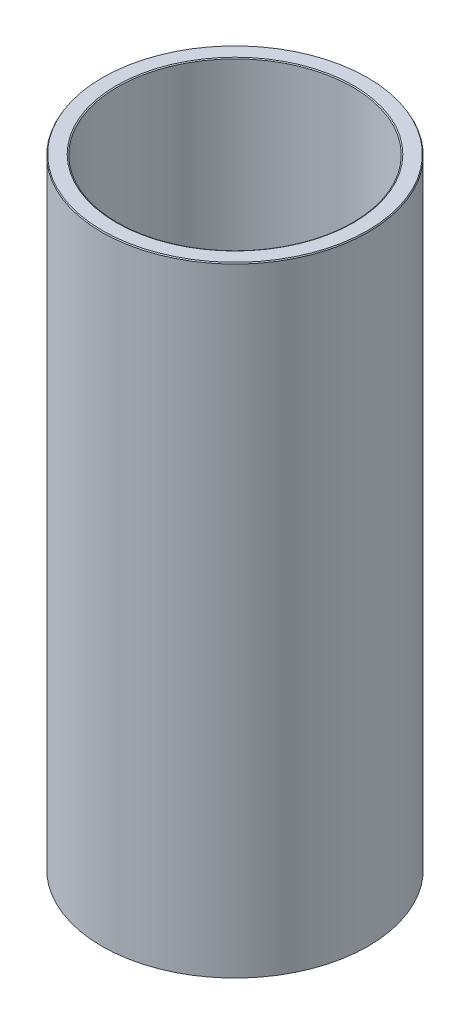
ISO-10303-21;
HEADER;
FILE_DESCRIPTION(('STEP AP214'),'2;1');
FILE_NAME('part.step','',(''),(''),'','','');
FILE_SCHEMA(('AUTOMOTIVE_DESIGN { 1 0 10303 214 1 1 1 1 }'));
ENDSEC;
DATA;
#1=APPLICATION_CONTEXT('core data for automotive mechanical design processes');
#2=APPLICATION_PROTOCOL_DEFINITION('international standard','automotive_design',2000,#1);
#3=PRODUCT_CONTEXT('',#1,'mechanical');
#4=PRODUCT('Part','Part','',(#3));
#5=PRODUCT_RELATED_PRODUCT_CATEGORY('part','',(#4));
#6=PRODUCT_DEFINITION_FORMATION('','',#4);
#7=PRODUCT_DEFINITION_CONTEXT('part definition',#1,'design');
#8=PRODUCT_DEFINITION('design','',#6,#7);
#9=PRODUCT_DEFINITION_SHAPE('','',#8);
#10=(LENGTH_UNIT() NAMED_UNIT(*) SI_UNIT(.MILLI.,.METRE.));
#11=(NAMED_UNIT(*) PLANE_ANGLE_UNIT() SI_UNIT($,.RADIAN.));
#12=(NAMED_UNIT(*) SI_UNIT($,.STERADIAN.) SOLID_ANGLE_UNIT());
#13=UNCERTAINTY_MEASURE_WITH_UNIT(LENGTH_MEASURE(1.E-05),#10,'distance_accuracy_value','');
#14=(GEOMETRIC_REPRESENTATION_CONTEXT(3) GLOBAL_UNCERTAINTY_ASSIGNED_CONTEXT((#13)) GLOBAL_UNIT_ASSIGNED_CONTEXT((#10,
#11,#12)) REPRESENTATION_CONTEXT('',''));
#15=CARTESIAN_POINT('',(0.,0.,0.));
#16=DIRECTION('',(0.,0.,1.));
#17=DIRECTION('',(1.,0.,0.));
#18=AXIS2_PLACEMENT_3D('',#15,#16,#17);
#19=CARTESIAN_POINT('',(0.,186.253668168116,0.));
#20=DIRECTION('',(0.,-1.,0.));
#21=DIRECTION('',(0.,0.,-1.));
#22=AXIS2_PLACEMENT_3D('',#19,#20,#21);
#23=CYLINDRICAL_SURFACE('',#22,40.);
#24=CARTESIAN_POINT('',(0.,0.194011640771735,0.));
#25=DIRECTION('',(0.,1.,0.));
#26=DIRECTION('',(0.,0.,1.));
#27=AXIS2_PLACEMENT_3D('',#24,#25,#26);
#28=CIRCLE('',#27,40.);
#29=CARTESIAN_POINT('',(0.,0.194011640771735,40.));
#30=VERTEX_POINT('',#29);
#31=EDGE_CURVE('E10',#30,#30,#28,.T.);
#32=ORIENTED_EDGE('',*,*,#31,.T.);
#33=EDGE_LOOP('',(#32));
#34=FACE_BOUND('',#33,.T.);
#35=CARTESIAN_POINT('',(0.,185.917630149039,0.));
#36=DIRECTION('',(0.,1.,0.));
#37=DIRECTION('',(0.,0.,1.));
#38=AXIS2_PLACEMENT_3D('',#35,#36,#37);
#39=CIRCLE('',#38,40.);
#40=CARTESIAN_POINT('',(0.,185.917630149039,40.));
#41=VERTEX_POINT('',#40);
#42=EDGE_CURVE('E50',#41,#41,#39,.F.);
#43=ORIENTED_EDGE('',*,*,#42,.T.);
#44=EDGE_LOOP('',(#43));
#45=FACE_BOUND('',#44,.T.);
#46=ADVANCED_FACE('F39',(#34,#45),#23,.T.);
#47=CARTESIAN_POINT('',(0.,186.253668168116,0.));
#48=DIRECTION('',(0.,1.,0.));
#49=DIRECTION('',(0.,0.,1.));
#50=AXIS2_PLACEMENT_3D('',#47,#48,#49);
#51=PLANE('',#50);
#52=CARTESIAN_POINT('',(0.,186.253668168116,0.));
#53=DIRECTION('',(0.,1.,0.));
#54=DIRECTION('',(0.,0.,1.));
#55=AXIS2_PLACEMENT_3D('',#52,#53,#54);
#56=CIRCLE('',#55,35.6508248401916);
#57=CARTESIAN_POINT('',(0.,186.253668168116,35.6508248401916));
#58=VERTEX_POINT('',#57);
#59=EDGE_CURVE('E58',#58,#58,#56,.F.);
#60=ORIENTED_EDGE('',*,*,#59,.T.);
#61=EDGE_LOOP('',(#60));
#62=FACE_BOUND('',#61,.T.);
#63=CARTESIAN_POINT('',(0.,186.253668168116,0.));
#64=DIRECTION('',(0.,1.,0.));
#65=DIRECTION('',(0.,0.,1.));
#66=AXIS2_PLACEMENT_3D('',#63,#64,#65);
#67=CIRCLE('',#66,39.8059883592282);
#68=CARTESIAN_POINT('',(0.,186.253668168116,39.8059883592282));
#69=VERTEX_POINT('',#68);
#70=EDGE_CURVE('E61',#69,#69,#67,.T.);
#71=ORIENTED_EDGE('',*,*,#70,.T.);
#72=EDGE_LOOP('',(#71));
#73=FACE_BOUND('',#72,.T.);
#74=ADVANCED_FACE('F88',(#62,#73),#51,.T.);
#75=CARTESIAN_POINT('',(0.,0.,0.));
#76=DIRECTION('',(0.,1.,0.));
#77=DIRECTION('',(0.,0.,1.));
#78=AXIS2_PLACEMENT_3D('',#75,#76,#77);
#79=PLANE('',#78);
#80=CARTESIAN_POINT('',(0.,0.,0.));
#81=DIRECTION('',(0.,1.,0.));
#82=DIRECTION('',(0.,0.,1.));
#83=AXIS2_PLACEMENT_3D('',#80,#81,#82);
#84=CIRCLE('',#83,35.5087984618869);
#85=CARTESIAN_POINT('',(0.,0.,35.5087984618869));
#86=VERTEX_POINT('',#85);
#87=EDGE_CURVE('E51',#86,#86,#84,.T.);
#88=ORIENTED_EDGE('',*,*,#87,.T.);
#89=EDGE_LOOP('',(#88));
#90=FACE_BOUND('',#89,.T.);
#91=CARTESIAN_POINT('',(0.,0.,0.));
#92=DIRECTION('',(0.,1.,0.));
#93=DIRECTION('',(0.,0.,1.));
#94=AXIS2_PLACEMENT_3D('',#91,#92,#93);
#95=CIRCLE('',#94,39.6639619809236);
#96=CARTESIAN_POINT('',(0.,0.,39.6639619809236));
#97=VERTEX_POINT('',#96);
#98=EDGE_CURVE('E54',#97,#97,#95,.F.);
#99=ORIENTED_EDGE('',*,*,#98,.T.);
#100=EDGE_LOOP('',(#99));
#101=FACE_BOUND('',#100,.T.);
#102=ADVANCED_FACE('F83',(#90,#101),#79,.F.);
#103=CARTESIAN_POINT('',(0.,186.253668168116,0.));
#104=DIRECTION('',(0.,-1.,0.));
#105=DIRECTION('',(0.,0.,-1.));
#106=AXIS2_PLACEMENT_3D('',#103,#104,#105);
#107=CYLINDRICAL_SURFACE('',#106,35.3147868211152);
#108=CARTESIAN_POINT('',(0.,186.059656527344,0.));
#109=DIRECTION('',(0.,1.,0.));
#110=DIRECTION('',(0.,0.,1.));
#111=AXIS2_PLACEMENT_3D('',#108,#109,#110);
#112=CIRCLE('',#111,35.3147868211152);
#113=CARTESIAN_POINT('',(0.,186.059656527344,35.3147868211152));
#114=VERTEX_POINT('',#113);
#115=EDGE_CURVE('E67',#114,#114,#112,.T.);
#116=ORIENTED_EDGE('',*,*,#115,.T.);
#117=EDGE_LOOP('',(#116));
#118=FACE_BOUND('',#117,.T.);
#119=CARTESIAN_POINT('',(0.,0.336038019076473,0.));
#120=DIRECTION('',(0.,1.,0.));
#121=DIRECTION('',(0.,0.,1.));
#122=AXIS2_PLACEMENT_3D('',#119,#120,#121);
#123=CIRCLE('',#122,35.3147868211152);
#124=CARTESIAN_POINT('',(0.,0.336038019076473,35.3147868211152));
#125=VERTEX_POINT('',#124);
#126=EDGE_CURVE('E69',#125,#125,#123,.F.);
#127=ORIENTED_EDGE('',*,*,#126,.T.);
#128=EDGE_LOOP('',(#127));
#129=FACE_BOUND('',#128,.T.);
#130=ADVANCED_FACE('F71',(#118,#129),#107,.F.);
#131=CARTESIAN_POINT('',(0.,186.059656527344,0.));
#132=DIRECTION('',(0.,1.,0.));
#133=DIRECTION('',(0.,0.,1.));
#134=AXIS2_PLACEMENT_3D('',#131,#132,#133);
#135=CONICAL_SURFACE('',#134,35.3147868211152,1.04719755119661);
#136=CARTESIAN_POINT('',(0.,186.253668168116,35.6508248401916));
#137=CARTESIAN_POINT('',(0.,186.251647213525,35.6473244441596));
#138=CARTESIAN_POINT('',(0.,186.249626258933,35.6438240481275));
#139=CARTESIAN_POINT('',(0.,186.24558434975,35.6368232560634));
#140=CARTESIAN_POINT('',(0.,186.243563395159,35.6333228600314));
#141=CARTESIAN_POINT('',(0.,186.239521485976,35.6263220679673));
#142=CARTESIAN_POINT('',(0.,186.237500531385,35.6228216719352));
#143=CARTESIAN_POINT('',(0.,186.233458622202,35.6158208798711));
#144=CARTESIAN_POINT('',(0.,186.231437667611,35.6123204838391));
#145=CARTESIAN_POINT('',(0.,186.227395758428,35.605319691775));
#146=CARTESIAN_POINT('',(0.,186.225374803837,35.601819295743));
#147=CARTESIAN_POINT('',(0.,186.221332894654,35.5948185036789));
#148=CARTESIAN_POINT('',(0.,186.219311940063,35.5913181076468));
#149=CARTESIAN_POINT('',(0.,186.21527003088,35.5843173155827));
#150=CARTESIAN_POINT('',(0.,186.213249076288,35.5808169195507));
#151=CARTESIAN_POINT('',(0.,186.209207167106,35.5738161274866));
#152=CARTESIAN_POINT('',(0.,186.207186212514,35.5703157314545));
#153=CARTESIAN_POINT('',(0.,186.203144303332,35.5633149393905));
#154=CARTESIAN_POINT('',(0.,186.20112334874,35.5598145433584));
#155=CARTESIAN_POINT('',(0.,186.197081439557,35.5528137512943));
#156=CARTESIAN_POINT('',(0.,186.195060484966,35.5493133552623));
#157=CARTESIAN_POINT('',(0.,186.191018575783,35.5423125631982));
#158=CARTESIAN_POINT('',(0.,186.188997621192,35.5388121671661));
#159=CARTESIAN_POINT('',(0.,186.184955712009,35.531811375102));
#160=CARTESIAN_POINT('',(0.,186.182934757418,35.52831097907));
#161=CARTESIAN_POINT('',(0.,186.178892848235,35.5213101870059));
#162=CARTESIAN_POINT('',(0.,186.176871893644,35.5178097909738));
#163=CARTESIAN_POINT('',(0.,186.172829984461,35.5108089989098));
#164=CARTESIAN_POINT('',(0.,186.17080902987,35.5073086028777));
#165=CARTESIAN_POINT('',(0.,186.166767120687,35.5003078108136));
#166=CARTESIAN_POINT('',(0.,186.164746166096,35.4968074147816));
#167=CARTESIAN_POINT('',(0.,186.160704256913,35.4898066227175));
#168=CARTESIAN_POINT('',(0.,186.158683302321,35.4863062266854));
#169=CARTESIAN_POINT('',(0.,186.154641393139,35.4793054346213));
#170=CARTESIAN_POINT('',(0.,186.152620438547,35.4758050385893));
#171=CARTESIAN_POINT('',(0.,186.148578529365,35.4688042465252));
#172=CARTESIAN_POINT('',(0.,186.146557574773,35.4653038504932));
#173=CARTESIAN_POINT('',(0.,186.14251566559,35.4583030584291));
#174=CARTESIAN_POINT('',(0.,186.140494710999,35.454802662397));
#175=CARTESIAN_POINT('',(0.,186.136452801816,35.4478018703329));
#176=CARTESIAN_POINT('',(0.,186.134431847225,35.4443014743009));
#177=CARTESIAN_POINT('',(0.,186.130389938042,35.4373006822368));
#178=CARTESIAN_POINT('',(0.,186.128368983451,35.4338002862047));
#179=CARTESIAN_POINT('',(0.,186.124327074268,35.4267994941406));
#180=CARTESIAN_POINT('',(0.,186.122306119677,35.4232990981086));
#181=CARTESIAN_POINT('',(0.,186.118264210494,35.4162983060445));
#182=CARTESIAN_POINT('',(0.,186.116243255903,35.4127979100125));
#183=CARTESIAN_POINT('',(0.,186.11220134672,35.4057971179484));
#184=CARTESIAN_POINT('',(0.,186.110180392128,35.4022967219163));
#185=CARTESIAN_POINT('',(0.,186.106138482946,35.3952959298522));
#186=CARTESIAN_POINT('',(0.,186.104117528354,35.3917955338202));
#187=CARTESIAN_POINT('',(0.,186.100075619172,35.3847947417561));
#188=CARTESIAN_POINT('',(0.,186.09805466458,35.381294345724));
#189=CARTESIAN_POINT('',(0.,186.094012755398,35.3742935536599));
#190=CARTESIAN_POINT('',(0.,186.091991800806,35.3707931576279));
#191=CARTESIAN_POINT('',(0.,186.087949891623,35.3637923655638));
#192=CARTESIAN_POINT('',(0.,186.085928937032,35.3602919695318));
#193=CARTESIAN_POINT('',(0.,186.081887027849,35.3532911774677));
#194=CARTESIAN_POINT('',(0.,186.079866073258,35.3497907814356));
#195=CARTESIAN_POINT('',(0.,186.075824164075,35.3427899893715));
#196=CARTESIAN_POINT('',(0.,186.073803209484,35.3392895933395));
#197=CARTESIAN_POINT('',(0.,186.069761300301,35.3322888012754));
#198=CARTESIAN_POINT('',(0.,186.06774034571,35.3287884052433));
#199=CARTESIAN_POINT('',(0.,186.063698436527,35.3217876131793));
#200=CARTESIAN_POINT('',(0.,186.061677481936,35.3182872171472));
#201=CARTESIAN_POINT('',(0.,186.059656527344,35.3147868211152));
#202=B_SPLINE_CURVE_WITH_KNOTS('',3,(#136,#137,#138,#139,#140,#141,#142,#143,#144,#145,#146,
#147,#148,#149,#150,#151,#152,#153,#154,#155,#156,#157,#158,#159,#160,#161,#162,#163,#164,#165,
#166,#167,#168,#169,#170,#171,#172,#173,#174,#175,#176,#177,#178,#179,#180,#181,#182,#183,#184,
#185,#186,#187,#188,#189,#190,#191,#192,#193,#194,#195,#196,#197,#198,#199,#200,#201),
.UNSPECIFIED.,.F.,.F.,(4,2,2,2,2,2,2,2,2,2,2,2,2,2,2,2,2,2,2,2,2,2,2,2,2,2,2,2,2,2,2,2,4),(0.,
0.0121257275482494,0.0242514550964789,0.0363771826447084,0.0485029101929518,0.0606286377411813,
0.0727543652894108,0.0848800928376403,0.0970058203858837,0.109131547934113,0.121257275482343,
0.133383003030586,0.145508730578816,0.157634458127045,0.169760185675275,0.181885913223518,
0.194011640771748,0.206137368319983,0.218263095868227,0.230388823416456,0.242514550964686,
0.254640278512915,0.266766006061158,0.278891733609388,0.291017461157617,0.303143188705861,
0.31526891625409,0.32739464380232,0.339520371350549,0.351646098898793,0.363771826447022,
0.375897553995252,0.388023281543481),.UNSPECIFIED.);
#203=EDGE_CURVE('BSEAM77',#58,#114,#202,.T.);
#204=ORIENTED_EDGE('',*,*,#59,.F.);
#205=ORIENTED_EDGE('',*,*,#115,.F.);
#206=ORIENTED_EDGE('',*,*,#203,.T.);
#207=ORIENTED_EDGE('',*,*,#203,.F.);
#208=EDGE_LOOP('',(#204,#206,#205,#207));
#209=FACE_BOUND('',#208,.T.);
#210=ADVANCED_FACE('F77',(#209),#135,.F.);
#211=CARTESIAN_POINT('',(0.,0.,0.));
#212=DIRECTION('',(0.,-1.,0.));
#213=DIRECTION('',(0.,0.,-1.));
#214=AXIS2_PLACEMENT_3D('',#211,#212,#213);
#215=CONICAL_SURFACE('',#214,35.5087984618869,0.523598775598327);
#216=ORIENTED_EDGE('',*,*,#126,.F.);
#217=EDGE_LOOP('',(#216));
#218=FACE_BOUND('',#217,.T.);
#219=ORIENTED_EDGE('',*,*,#87,.F.);
#220=EDGE_LOOP('',(#219));
#221=FACE_BOUND('',#220,.T.);
#222=ADVANCED_FACE('F73',(#218,#221),#215,.F.);
#223=CARTESIAN_POINT('',(0.,0.194011640771735,0.));
#224=DIRECTION('',(0.,1.,0.));
#225=DIRECTION('',(0.,0.,1.));
#226=AXIS2_PLACEMENT_3D('',#223,#224,#225);
#227=CONICAL_SURFACE('',#226,40.,1.04719755119655);
#228=CARTESIAN_POINT('',(0.,0.,39.6639619809236));
#229=CARTESIAN_POINT('',(0.,0.00202095459137203,39.6674623769556));
#230=CARTESIAN_POINT('',(0.,0.00404190918274436,39.6709627729877));
#231=CARTESIAN_POINT('',(0.,0.00808381836548903,39.6779635650518));
#232=CARTESIAN_POINT('',(0.,0.0101047729568614,39.6814639610838));
#233=CARTESIAN_POINT('',(0.,0.0141466821396055,39.6884647531479));
#234=CARTESIAN_POINT('',(0.,0.0161676367309773,39.69196514918));
#235=CARTESIAN_POINT('',(0.,0.020209545913722,39.698965941244));
#236=CARTESIAN_POINT('',(0.,0.022230500505095,39.7024663372761));
#237=CARTESIAN_POINT('',(0.,0.0262724096878397,39.7094671293402));
#238=CARTESIAN_POINT('',(0.,0.0282933642792115,39.7129675253722));
#239=CARTESIAN_POINT('',(0.,0.0323352734619557,39.7199683174363));
#240=CARTESIAN_POINT('',(0.,0.034356228053328,39.7234687134684));
#241=CARTESIAN_POINT('',(0.,0.0383981372360726,39.7304695055325));
#242=CARTESIAN_POINT('',(0.,0.0404190918274448,39.7339699015645));
#243=CARTESIAN_POINT('',(0.,0.0444610010101893,39.7409706936286));
#244=CARTESIAN_POINT('',(0.,0.0464819556015617,39.7444710896606));
#245=CARTESIAN_POINT('',(0.,0.0505238647843058,39.7514718817247));
#246=CARTESIAN_POINT('',(0.,0.0525448193756776,39.7549722777568));
#247=CARTESIAN_POINT('',(0.,0.0565867285584224,39.7619730698209));
#248=CARTESIAN_POINT('',(0.,0.0586076831497953,39.7654734658529));
#249=CARTESIAN_POINT('',(0.,0.0626495923325401,39.772474257917));
#250=CARTESIAN_POINT('',(0.,0.0646705469239119,39.7759746539491));
#251=CARTESIAN_POINT('',(0.,0.068712456106656,39.7829754460131));
#252=CARTESIAN_POINT('',(0.,0.0707334106980284,39.7864758420452));
#253=CARTESIAN_POINT('',(0.,0.0747753198807729,39.7934766341093));
#254=CARTESIAN_POINT('',(0.,0.0767962744721451,39.7969770301413));
#255=CARTESIAN_POINT('',(0.,0.0808381836548897,39.8039778222054));
#256=CARTESIAN_POINT('',(0.,0.082859138246262,39.8074782182375));
#257=CARTESIAN_POINT('',(0.,0.0869010474290062,39.8144790103016));
#258=CARTESIAN_POINT('',(0.,0.088922002020378,39.8179794063336));
#259=CARTESIAN_POINT('',(0.,0.0929639112031227,39.8249801983977));
#260=CARTESIAN_POINT('',(0.,0.0949848657944957,39.8284805944297));
#261=CARTESIAN_POINT('',(0.,0.0990267749772404,39.8354813864938));
#262=CARTESIAN_POINT('',(0.,0.101047729568612,39.8389817825259));
#263=CARTESIAN_POINT('',(0.,0.105089638751356,39.84598257459));
#264=CARTESIAN_POINT('',(0.,0.107110593342729,39.849482970622));
#265=CARTESIAN_POINT('',(0.,0.111152502525473,39.8564837626861));
#266=CARTESIAN_POINT('',(0.,0.113173457116846,39.8599841587182));
#267=CARTESIAN_POINT('',(0.,0.11721536629959,39.8669849507823));
#268=CARTESIAN_POINT('',(0.,0.119236320890962,39.8704853468143));
#269=CARTESIAN_POINT('',(0.,0.123278230073707,39.8774861388784));
#270=CARTESIAN_POINT('',(0.,0.125299184665079,39.8809865349104));
#271=CARTESIAN_POINT('',(0.,0.129341093847823,39.8879873269745));
#272=CARTESIAN_POINT('',(0.,0.131362048439195,39.8914877230066));
#273=CARTESIAN_POINT('',(0.,0.13540395762194,39.8984885150707));
#274=CARTESIAN_POINT('',(0.,0.137424912213313,39.9019889111027));
#275=CARTESIAN_POINT('',(0.,0.141466821396058,39.9089897031668));
#276=CARTESIAN_POINT('',(0.,0.143487775987429,39.9124900991989));
#277=CARTESIAN_POINT('',(0.,0.147529685170173,39.9194908912629));
#278=CARTESIAN_POINT('',(0.,0.149550639761546,39.922991287295));
#279=CARTESIAN_POINT('',(0.,0.15359254894429,39.9299920793591));
#280=CARTESIAN_POINT('',(0.,0.155613503535663,39.9334924753911));
#281=CARTESIAN_POINT('',(0.,0.159655412718407,39.9404932674552));
#282=CARTESIAN_POINT('',(0.,0.161676367309779,39.9439936634873));
#283=CARTESIAN_POINT('',(0.,0.165718276492524,39.9509944555514));
#284=CARTESIAN_POINT('',(0.,0.167739231083895,39.9544948515834));
#285=CARTESIAN_POINT('',(0.,0.17178114026664,39.9614956436475));
#286=CARTESIAN_POINT('',(0.,0.173802094858013,39.9649960396795));
#287=CARTESIAN_POINT('',(0.,0.177844004040758,39.9719968317436));
#288=CARTESIAN_POINT('',(0.,0.17986495863213,39.9754972277757));
#289=CARTESIAN_POINT('',(0.,0.183906867814874,39.9824980198398));
#290=CARTESIAN_POINT('',(0.,0.185927822406246,39.9859984158718));
#291=CARTESIAN_POINT('',(0.,0.189969731588991,39.9929992079359));
#292=CARTESIAN_POINT('',(0.,0.191990686180363,39.996499603968));
#293=CARTESIAN_POINT('',(0.,0.194011640771735,40.));
#294=B_SPLINE_CURVE_WITH_KNOTS('',3,(#228,#229,#230,#231,#232,#233,#234,#235,#236,#237,#238,
#239,#240,#241,#242,#243,#244,#245,#246,#247,#248,#249,#250,#251,#252,#253,#254,#255,#256,#257,
#258,#259,#260,#261,#262,#263,#264,#265,#266,#267,#268,#269,#270,#271,#272,#273,#274,#275,#276,
#277,#278,#279,#280,#281,#282,#283,#284,#285,#286,#287,#288,#289,#290,#291,#292,#293),
.UNSPECIFIED.,.F.,.F.,(4,2,2,2,2,2,2,2,2,2,2,2,2,2,2,2,2,2,2,2,2,2,2,2,2,2,2,2,2,2,2,2,4),(0.,
0.0121257275482334,0.0242514550964668,0.0363771826447002,0.0485029101929276,0.0606286377411611,
0.0727543652893945,0.0848800928376279,0.0970058203858613,0.109131547934095,0.121257275482322,
0.133383003030556,0.145508730578789,0.157634458127022,0.169760185675256,0.181885913223489,
0.194011640771717,0.20613736831995,0.218263095868183,0.230388823416417,0.24251455096465,
0.254640278512884,0.266766006061117,0.278891733609345,0.291017461157578,0.303143188705811,
0.315268916254045,0.327394643802278,0.339520371350512,0.351646098898739,0.363771826446972,
0.375897553995206,0.388023281543439),.UNSPECIFIED.);
#295=EDGE_CURVE('BSEAM76',#97,#30,#294,.T.);
#296=ORIENTED_EDGE('',*,*,#98,.F.);
#297=ORIENTED_EDGE('',*,*,#31,.F.);
#298=ORIENTED_EDGE('',*,*,#295,.T.);
#299=ORIENTED_EDGE('',*,*,#295,.F.);
#300=EDGE_LOOP('',(#296,#298,#297,#299));
#301=FACE_BOUND('',#300,.T.);
#302=ADVANCED_FACE('F76',(#301),#227,.T.);
#303=CARTESIAN_POINT('',(0.,186.253668168116,0.));
#304=DIRECTION('',(0.,-1.,0.));
#305=DIRECTION('',(0.,0.,-1.));
#306=AXIS2_PLACEMENT_3D('',#303,#304,#305);
#307=CONICAL_SURFACE('',#306,39.8059883592282,0.523598775598332);
#308=ORIENTED_EDGE('',*,*,#42,.F.);
#309=EDGE_LOOP('',(#308));
#310=FACE_BOUND('',#309,.T.);
#311=ORIENTED_EDGE('',*,*,#70,.F.);
#312=EDGE_LOOP('',(#311));
#313=FACE_BOUND('',#312,.T.);
#314=ADVANCED_FACE('F45',(#310,#313),#307,.T.);
#315=CLOSED_SHELL('',(#46,#74,#102,#130,#210,#222,#302,#314));
#316=MANIFOLD_SOLID_BREP('B2',#315);
#317=ADVANCED_BREP_SHAPE_REPRESENTATION('',(#18,#316),#14);
#318=SHAPE_DEFINITION_REPRESENTATION(#9,#317);
ENDSEC;
END-ISO-10303-21;
